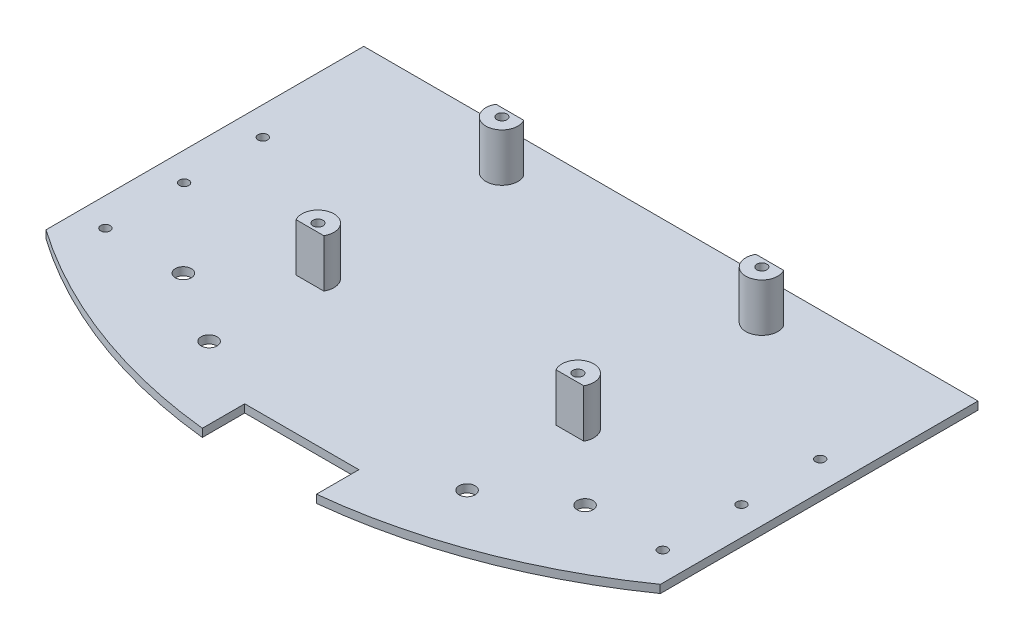
ISO-10303-21;
HEADER;
FILE_DESCRIPTION(('STEP AP214'),'2;1');
FILE_NAME('part.step','',(''),(''),'','','');
FILE_SCHEMA(('AUTOMOTIVE_DESIGN { 1 0 10303 214 1 1 1 1 }'));
ENDSEC;
DATA;
#1=APPLICATION_CONTEXT('core data for automotive mechanical design processes');
#2=APPLICATION_PROTOCOL_DEFINITION('international standard','automotive_design',2000,#1);
#3=PRODUCT_CONTEXT('',#1,'mechanical');
#4=PRODUCT('Part','Part','',(#3));
#5=PRODUCT_RELATED_PRODUCT_CATEGORY('part','',(#4));
#6=PRODUCT_DEFINITION_FORMATION('','',#4);
#7=PRODUCT_DEFINITION_CONTEXT('part definition',#1,'design');
#8=PRODUCT_DEFINITION('design','',#6,#7);
#9=PRODUCT_DEFINITION_SHAPE('','',#8);
#10=(LENGTH_UNIT() NAMED_UNIT(*) SI_UNIT(.MILLI.,.METRE.));
#11=(NAMED_UNIT(*) PLANE_ANGLE_UNIT() SI_UNIT($,.RADIAN.));
#12=(NAMED_UNIT(*) SI_UNIT($,.STERADIAN.) SOLID_ANGLE_UNIT());
#13=UNCERTAINTY_MEASURE_WITH_UNIT(LENGTH_MEASURE(1.E-05),#10,'distance_accuracy_value','');
#14=(GEOMETRIC_REPRESENTATION_CONTEXT(3) GLOBAL_UNCERTAINTY_ASSIGNED_CONTEXT((#13)) GLOBAL_UNIT_ASSIGNED_CONTEXT((#10,
#11,#12)) REPRESENTATION_CONTEXT('',''));
#15=CARTESIAN_POINT('',(0.,0.,0.));
#16=DIRECTION('',(0.,0.,1.));
#17=DIRECTION('',(1.,0.,0.));
#18=AXIS2_PLACEMENT_3D('',#15,#16,#17);
#19=CARTESIAN_POINT('',(0.,2.54,0.));
#20=DIRECTION('',(0.,-1.,0.));
#21=DIRECTION('',(0.,0.,-1.));
#22=AXIS2_PLACEMENT_3D('',#19,#20,#21);
#23=PLANE('',#22);
#24=DIRECTION('',(1.,0.,0.));
#25=VECTOR('',#24,1.);
#26=CARTESIAN_POINT('',(0.,2.54,-78.74));
#27=LINE('',#26,#25);
#28=CARTESIAN_POINT('',(52.1718334230053,2.54,-78.74));
#29=VERTEX_POINT('',#28);
#30=CARTESIAN_POINT('',(60.9706515254552,2.54,-78.74));
#31=VERTEX_POINT('',#30);
#32=EDGE_CURVE('E176',#29,#31,#27,.T.);
#33=ORIENTED_EDGE('',*,*,#32,.F.);
#34=CARTESIAN_POINT('',(56.5712424742303,2.54,-81.28));
#35=DIRECTION('',(0.,1.,0.));
#36=DIRECTION('',(0.,0.,1.));
#37=AXIS2_PLACEMENT_3D('',#34,#35,#36);
#38=CIRCLE('',#37,5.08000000000001);
#39=EDGE_CURVE('E55',#31,#29,#38,.T.);
#40=ORIENTED_EDGE('',*,*,#39,.F.);
#41=EDGE_LOOP('',(#33,#40));
#42=FACE_BOUND('',#41,.T.);
#43=CARTESIAN_POINT('',(56.5712424742303,2.54,-139.7));
#44=DIRECTION('',(0.,1.,0.));
#45=DIRECTION('',(0.,0.,1.));
#46=AXIS2_PLACEMENT_3D('',#43,#44,#45);
#47=CIRCLE('',#46,5.07999999999999);
#48=CARTESIAN_POINT('',(52.1718334230053,2.54,-142.24));
#49=VERTEX_POINT('',#48);
#50=CARTESIAN_POINT('',(60.9706515254552,2.54,-142.24));
#51=VERTEX_POINT('',#50);
#52=EDGE_CURVE('E222',#49,#51,#47,.T.);
#53=ORIENTED_EDGE('',*,*,#52,.F.);
#54=DIRECTION('',(1.,0.,0.));
#55=VECTOR('',#54,1.);
#56=CARTESIAN_POINT('',(0.,2.54,-142.24));
#57=LINE('',#56,#55);
#58=EDGE_CURVE('E217',#49,#51,#57,.T.);
#59=ORIENTED_EDGE('',*,*,#58,.T.);
#60=EDGE_LOOP('',(#53,#59));
#61=FACE_BOUND('',#60,.T.);
#62=CARTESIAN_POINT('',(9.00000000000001,2.54,-86.35));
#63=DIRECTION('',(0.,1.,0.));
#64=DIRECTION('',(0.,0.,1.));
#65=AXIS2_PLACEMENT_3D('',#62,#63,#64);
#66=CIRCLE('',#65,1.5);
#67=CARTESIAN_POINT('',(9.00000000000001,2.54,-84.85));
#68=VERTEX_POINT('',#67);
#69=EDGE_CURVE('E285',#68,#68,#66,.T.);
#70=ORIENTED_EDGE('',*,*,#69,.F.);
#71=EDGE_LOOP('',(#70));
#72=FACE_BOUND('',#71,.T.);
#73=CARTESIAN_POINT('',(9.00000000000001,2.54,-111.35));
#74=DIRECTION('',(0.,1.,0.));
#75=DIRECTION('',(0.,0.,1.));
#76=AXIS2_PLACEMENT_3D('',#73,#74,#75);
#77=CIRCLE('',#76,1.5);
#78=CARTESIAN_POINT('',(9.00000000000001,2.54,-109.85));
#79=VERTEX_POINT('',#78);
#80=EDGE_CURVE('E327',#79,#79,#77,.T.);
#81=ORIENTED_EDGE('',*,*,#80,.F.);
#82=EDGE_LOOP('',(#81));
#83=FACE_BOUND('',#82,.T.);
#84=CARTESIAN_POINT('',(186.,2.54,-111.35));
#85=DIRECTION('',(0.,1.,0.));
#86=DIRECTION('',(0.,0.,1.));
#87=AXIS2_PLACEMENT_3D('',#84,#85,#86);
#88=CIRCLE('',#87,1.5);
#89=CARTESIAN_POINT('',(186.,2.54,-109.85));
#90=VERTEX_POINT('',#89);
#91=EDGE_CURVE('E321',#90,#90,#88,.T.);
#92=ORIENTED_EDGE('',*,*,#91,.F.);
#93=EDGE_LOOP('',(#92));
#94=FACE_BOUND('',#93,.T.);
#95=CARTESIAN_POINT('',(186.,2.54,-86.35));
#96=DIRECTION('',(0.,1.,0.));
#97=DIRECTION('',(0.,0.,1.));
#98=AXIS2_PLACEMENT_3D('',#95,#96,#97);
#99=CIRCLE('',#98,1.5);
#100=CARTESIAN_POINT('',(186.,2.54,-84.85));
#101=VERTEX_POINT('',#100);
#102=EDGE_CURVE('E313',#101,#101,#99,.T.);
#103=ORIENTED_EDGE('',*,*,#102,.F.);
#104=EDGE_LOOP('',(#103));
#105=FACE_BOUND('',#104,.T.);
#106=CARTESIAN_POINT('',(186.,2.54,-61.35));
#107=DIRECTION('',(0.,1.,0.));
#108=DIRECTION('',(0.,0.,1.));
#109=AXIS2_PLACEMENT_3D('',#106,#107,#108);
#110=CIRCLE('',#109,1.5);
#111=CARTESIAN_POINT('',(186.,2.54,-59.85));
#112=VERTEX_POINT('',#111);
#113=EDGE_CURVE('E320',#112,#112,#110,.T.);
#114=ORIENTED_EDGE('',*,*,#113,.F.);
#115=EDGE_LOOP('',(#114));
#116=FACE_BOUND('',#115,.T.);
#117=CARTESIAN_POINT('',(33.7376441434235,2.54,-61.35));
#118=DIRECTION('',(0.,1.,0.));
#119=DIRECTION('',(0.,0.,1.));
#120=AXIS2_PLACEMENT_3D('',#117,#118,#119);
#121=CIRCLE('',#120,2.54);
#122=CARTESIAN_POINT('',(33.7376441434235,2.54,-58.81));
#123=VERTEX_POINT('',#122);
#124=EDGE_CURVE('E272',#123,#123,#121,.T.);
#125=ORIENTED_EDGE('',*,*,#124,.F.);
#126=EDGE_LOOP('',(#125));
#127=FACE_BOUND('',#126,.T.);
#128=CARTESIAN_POINT('',(56.5712424742303,2.54,-46.7057398290593));
#129=DIRECTION('',(0.,1.,0.));
#130=DIRECTION('',(0.,0.,1.));
#131=AXIS2_PLACEMENT_3D('',#128,#129,#130);
#132=CIRCLE('',#131,2.54);
#133=CARTESIAN_POINT('',(56.5712424742303,2.54,-44.1657398290593));
#134=VERTEX_POINT('',#133);
#135=EDGE_CURVE('E264',#134,#134,#132,.T.);
#136=ORIENTED_EDGE('',*,*,#135,.F.);
#137=EDGE_LOOP('',(#136));
#138=FACE_BOUND('',#137,.T.);
#139=CARTESIAN_POINT('',(9.00000000000001,2.54,-61.35));
#140=DIRECTION('',(0.,1.,0.));
#141=DIRECTION('',(0.,0.,1.));
#142=AXIS2_PLACEMENT_3D('',#139,#140,#141);
#143=CIRCLE('',#142,1.5);
#144=CARTESIAN_POINT('',(9.00000000000001,2.54,-59.85));
#145=VERTEX_POINT('',#144);
#146=EDGE_CURVE('E278',#145,#145,#143,.T.);
#147=ORIENTED_EDGE('',*,*,#146,.F.);
#148=EDGE_LOOP('',(#147));
#149=FACE_BOUND('',#148,.T.);
#150=CARTESIAN_POINT('',(161.334355856577,2.54,-61.35));
#151=DIRECTION('',(0.,1.,0.));
#152=DIRECTION('',(0.,0.,-1.));
#153=AXIS2_PLACEMENT_3D('',#150,#151,#152);
#154=CIRCLE('',#153,2.54000000000001);
#155=CARTESIAN_POINT('',(161.334355856577,2.54,-63.89));
#156=VERTEX_POINT('',#155);
#157=EDGE_CURVE('E303',#156,#156,#154,.T.);
#158=ORIENTED_EDGE('',*,*,#157,.F.);
#159=EDGE_LOOP('',(#158));
#160=FACE_BOUND('',#159,.T.);
#161=CARTESIAN_POINT('',(138.50075752577,2.54,-46.7057398290593));
#162=DIRECTION('',(0.,1.,0.));
#163=DIRECTION('',(0.,0.,-1.));
#164=AXIS2_PLACEMENT_3D('',#161,#162,#163);
#165=CIRCLE('',#164,2.54000000000001);
#166=CARTESIAN_POINT('',(138.50075752577,2.54,-49.2457398290593));
#167=VERTEX_POINT('',#166);
#168=EDGE_CURVE('E245',#167,#167,#165,.T.);
#169=ORIENTED_EDGE('',*,*,#168,.F.);
#170=EDGE_LOOP('',(#169));
#171=FACE_BOUND('',#170,.T.);
#172=DIRECTION('',(1.,0.,0.));
#173=VECTOR('',#172,1.);
#174=CARTESIAN_POINT('',(0.,2.54,-51.4885552279454));
#175=LINE('',#174,#173);
#176=CARTESIAN_POINT('',(195.,2.54,-51.4885552279454));
#177=VERTEX_POINT('',#176);
#178=CARTESIAN_POINT('',(195.072,2.54,-51.4885552279454));
#179=VERTEX_POINT('',#178);
#180=EDGE_CURVE('E237',#177,#179,#175,.T.);
#181=ORIENTED_EDGE('',*,*,#180,.T.);
#182=DIRECTION('',(0.,0.,-1.));
#183=VECTOR('',#182,1.);
#184=CARTESIAN_POINT('',(195.072,2.54,0.));
#185=LINE('',#184,#183);
#186=CARTESIAN_POINT('',(195.072,2.54,-152.4));
#187=VERTEX_POINT('',#186);
#188=EDGE_CURVE('E358',#179,#187,#185,.T.);
#189=ORIENTED_EDGE('',*,*,#188,.T.);
#190=DIRECTION('',(-1.,0.,0.));
#191=VECTOR('',#190,1.);
#192=CARTESIAN_POINT('',(0.,2.54,-152.4));
#193=LINE('',#192,#191);
#194=CARTESIAN_POINT('',(0.,2.54,-152.4));
#195=VERTEX_POINT('',#194);
#196=EDGE_CURVE('E361',#187,#195,#193,.T.);
#197=ORIENTED_EDGE('',*,*,#196,.T.);
#198=DIRECTION('',(0.,0.,1.));
#199=VECTOR('',#198,1.);
#200=CARTESIAN_POINT('',(0.,2.54,0.));
#201=LINE('',#200,#199);
#202=CARTESIAN_POINT('',(0.,2.54,-51.4885552279454));
#203=VERTEX_POINT('',#202);
#204=EDGE_CURVE('E355',#195,#203,#201,.T.);
#205=ORIENTED_EDGE('',*,*,#204,.T.);
#206=CARTESIAN_POINT('',(97.5,2.54,-190.75));
#207=DIRECTION('',(0.,1.,0.));
#208=DIRECTION('',(0.,0.,1.));
#209=AXIS2_PLACEMENT_3D('',#206,#207,#208);
#210=CIRCLE('',#209,170.);
#211=CARTESIAN_POINT('',(79.4085319033988,2.54,-21.7153917621908));
#212=VERTEX_POINT('',#211);
#213=EDGE_CURVE('E249',#203,#212,#210,.T.);
#214=ORIENTED_EDGE('',*,*,#213,.T.);
#215=DIRECTION('',(0.,0.,1.));
#216=VECTOR('',#215,1.);
#217=CARTESIAN_POINT('',(79.4085319033988,2.54,-35.1918965634894));
#218=LINE('',#217,#216);
#219=CARTESIAN_POINT('',(79.4085319033988,2.54,-35.1918965634894));
#220=VERTEX_POINT('',#219);
#221=EDGE_CURVE('E271',#220,#212,#218,.T.);
#222=ORIENTED_EDGE('',*,*,#221,.F.);
#223=DIRECTION('',(-1.,0.,0.));
#224=VECTOR('',#223,1.);
#225=CARTESIAN_POINT('',(79.4085319033988,2.54,-35.1918965634894));
#226=LINE('',#225,#224);
#227=CARTESIAN_POINT('',(115.663468096601,2.54,-35.1918965634894));
#228=VERTEX_POINT('',#227);
#229=EDGE_CURVE('E286',#228,#220,#226,.T.);
#230=ORIENTED_EDGE('',*,*,#229,.F.);
#231=DIRECTION('',(0.,0.,-1.));
#232=VECTOR('',#231,1.);
#233=CARTESIAN_POINT('',(115.663468096601,2.54,-35.1918965634894));
#234=LINE('',#233,#232);
#235=CARTESIAN_POINT('',(115.663468096601,2.54,-21.7231133023396));
#236=VERTEX_POINT('',#235);
#237=EDGE_CURVE('E290',#236,#228,#234,.T.);
#238=ORIENTED_EDGE('',*,*,#237,.F.);
#239=CARTESIAN_POINT('',(97.5,2.54,-190.75));
#240=DIRECTION('',(0.,1.,0.));
#241=DIRECTION('',(0.,0.,1.));
#242=AXIS2_PLACEMENT_3D('',#239,#240,#241);
#243=CIRCLE('',#242,170.);
#244=EDGE_CURVE('E242',#236,#177,#243,.T.);
#245=ORIENTED_EDGE('',*,*,#244,.T.);
#246=EDGE_LOOP('',(#181,#189,#197,#205,#214,#222,#230,#238,#245));
#247=FACE_BOUND('',#246,.T.);
#248=DIRECTION('',(-1.,0.,0.));
#249=VECTOR('',#248,1.);
#250=CARTESIAN_POINT('',(0.,2.54,-142.24));
#251=LINE('',#250,#249);
#252=CARTESIAN_POINT('',(143.520651525455,2.54,-142.24));
#253=VERTEX_POINT('',#252);
#254=CARTESIAN_POINT('',(134.721833423005,2.54,-142.24));
#255=VERTEX_POINT('',#254);
#256=EDGE_CURVE('E197',#253,#255,#251,.T.);
#257=ORIENTED_EDGE('',*,*,#256,.F.);
#258=CARTESIAN_POINT('',(139.12124247423,2.54,-139.7));
#259=DIRECTION('',(0.,1.,0.));
#260=DIRECTION('',(0.,0.,1.));
#261=AXIS2_PLACEMENT_3D('',#258,#259,#260);
#262=CIRCLE('',#261,5.07999999999999);
#263=EDGE_CURVE('E202',#255,#253,#262,.T.);
#264=ORIENTED_EDGE('',*,*,#263,.F.);
#265=EDGE_LOOP('',(#257,#264));
#266=FACE_BOUND('',#265,.T.);
#267=CARTESIAN_POINT('',(139.12124247423,2.54,-81.28));
#268=DIRECTION('',(0.,1.,0.));
#269=DIRECTION('',(0.,0.,1.));
#270=AXIS2_PLACEMENT_3D('',#267,#268,#269);
#271=CIRCLE('',#270,5.07999999999999);
#272=CARTESIAN_POINT('',(143.520651525455,2.54,-78.74));
#273=VERTEX_POINT('',#272);
#274=CARTESIAN_POINT('',(134.721833423005,2.54,-78.74));
#275=VERTEX_POINT('',#274);
#276=EDGE_CURVE('E62',#273,#275,#271,.T.);
#277=ORIENTED_EDGE('',*,*,#276,.F.);
#278=DIRECTION('',(-1.,0.,0.));
#279=VECTOR('',#278,1.);
#280=CARTESIAN_POINT('',(0.,2.54,-78.74));
#281=LINE('',#280,#279);
#282=EDGE_CURVE('E177',#273,#275,#281,.T.);
#283=ORIENTED_EDGE('',*,*,#282,.T.);
#284=EDGE_LOOP('',(#277,#283));
#285=FACE_BOUND('',#284,.T.);
#286=ADVANCED_FACE('F41',(#42,#61,#72,#83,#94,#105,#116,#127,#138,#149,#160,#171,#247,#266,
#285),#23,.F.);
#287=CARTESIAN_POINT('',(0.,2.54,0.));
#288=DIRECTION('',(1.,0.,0.));
#289=DIRECTION('',(0.,0.,-1.));
#290=AXIS2_PLACEMENT_3D('',#287,#288,#289);
#291=PLANE('',#290);
#292=DIRECTION('',(0.,1.,0.));
#293=VECTOR('',#292,1.);
#294=CARTESIAN_POINT('',(0.,-94.6402993365633,-51.4885552279454));
#295=LINE('',#294,#293);
#296=CARTESIAN_POINT('',(0.,0.,-51.4885552279454));
#297=VERTEX_POINT('',#296);
#298=EDGE_CURVE('E258',#297,#203,#295,.T.);
#299=ORIENTED_EDGE('',*,*,#298,.T.);
#300=ORIENTED_EDGE('',*,*,#204,.F.);
#301=DIRECTION('',(0.,-1.,0.));
#302=VECTOR('',#301,1.);
#303=CARTESIAN_POINT('',(0.,2.54,-152.4));
#304=LINE('',#303,#302);
#305=CARTESIAN_POINT('',(0.,0.,-152.4));
#306=VERTEX_POINT('',#305);
#307=EDGE_CURVE('E363',#195,#306,#304,.T.);
#308=ORIENTED_EDGE('',*,*,#307,.T.);
#309=DIRECTION('',(0.,0.,1.));
#310=VECTOR('',#309,1.);
#311=CARTESIAN_POINT('',(0.,0.,0.));
#312=LINE('',#311,#310);
#313=EDGE_CURVE('E354',#306,#297,#312,.T.);
#314=ORIENTED_EDGE('',*,*,#313,.T.);
#315=EDGE_LOOP('',(#299,#300,#308,#314));
#316=FACE_BOUND('',#315,.T.);
#317=ADVANCED_FACE('F43',(#316),#291,.F.);
#318=CARTESIAN_POINT('',(195.072,2.54,0.));
#319=DIRECTION('',(-1.,0.,0.));
#320=DIRECTION('',(0.,0.,1.));
#321=AXIS2_PLACEMENT_3D('',#318,#319,#320);
#322=PLANE('',#321);
#323=DIRECTION('',(0.,1.,0.));
#324=VECTOR('',#323,1.);
#325=CARTESIAN_POINT('',(195.072,-94.6402993365633,-51.4885552279454));
#326=LINE('',#325,#324);
#327=CARTESIAN_POINT('',(195.072,0.,-51.4885552279454));
#328=VERTEX_POINT('',#327);
#329=EDGE_CURVE('E251',#328,#179,#326,.T.);
#330=ORIENTED_EDGE('',*,*,#329,.F.);
#331=DIRECTION('',(0.,0.,-1.));
#332=VECTOR('',#331,1.);
#333=CARTESIAN_POINT('',(195.072,0.,0.));
#334=LINE('',#333,#332);
#335=CARTESIAN_POINT('',(195.072,0.,-152.4));
#336=VERTEX_POINT('',#335);
#337=EDGE_CURVE('E366',#328,#336,#334,.T.);
#338=ORIENTED_EDGE('',*,*,#337,.T.);
#339=DIRECTION('',(0.,-1.,0.));
#340=VECTOR('',#339,1.);
#341=CARTESIAN_POINT('',(195.072,2.54,-152.4));
#342=LINE('',#341,#340);
#343=EDGE_CURVE('E49',#187,#336,#342,.T.);
#344=ORIENTED_EDGE('',*,*,#343,.F.);
#345=ORIENTED_EDGE('',*,*,#188,.F.);
#346=EDGE_LOOP('',(#330,#338,#344,#345));
#347=FACE_BOUND('',#346,.T.);
#348=ADVANCED_FACE('F392',(#347),#322,.F.);
#349=CARTESIAN_POINT('',(0.,0.,0.));
#350=DIRECTION('',(0.,-1.,0.));
#351=DIRECTION('',(0.,0.,-1.));
#352=AXIS2_PLACEMENT_3D('',#349,#350,#351);
#353=PLANE('',#352);
#354=CARTESIAN_POINT('',(9.00000000000001,0.,-86.35));
#355=DIRECTION('',(0.,-1.,0.));
#356=DIRECTION('',(0.,0.,-1.));
#357=AXIS2_PLACEMENT_3D('',#354,#355,#356);
#358=CIRCLE('',#357,1.5);
#359=CARTESIAN_POINT('',(9.00000000000001,0.,-87.85));
#360=VERTEX_POINT('',#359);
#361=EDGE_CURVE('E330',#360,#360,#358,.F.);
#362=ORIENTED_EDGE('',*,*,#361,.T.);
#363=EDGE_LOOP('',(#362));
#364=FACE_BOUND('',#363,.T.);
#365=CARTESIAN_POINT('',(9.00000000000001,0.,-111.35));
#366=DIRECTION('',(0.,-1.,0.));
#367=DIRECTION('',(0.,0.,-1.));
#368=AXIS2_PLACEMENT_3D('',#365,#366,#367);
#369=CIRCLE('',#368,1.5);
#370=CARTESIAN_POINT('',(9.00000000000001,0.,-112.85));
#371=VERTEX_POINT('',#370);
#372=EDGE_CURVE('E324',#371,#371,#369,.F.);
#373=ORIENTED_EDGE('',*,*,#372,.T.);
#374=EDGE_LOOP('',(#373));
#375=FACE_BOUND('',#374,.T.);
#376=CARTESIAN_POINT('',(186.,0.,-111.35));
#377=DIRECTION('',(0.,-1.,0.));
#378=DIRECTION('',(0.,0.,-1.));
#379=AXIS2_PLACEMENT_3D('',#376,#377,#378);
#380=CIRCLE('',#379,1.5);
#381=CARTESIAN_POINT('',(186.,0.,-112.85));
#382=VERTEX_POINT('',#381);
#383=EDGE_CURVE('E317',#382,#382,#380,.F.);
#384=ORIENTED_EDGE('',*,*,#383,.T.);
#385=EDGE_LOOP('',(#384));
#386=FACE_BOUND('',#385,.T.);
#387=CARTESIAN_POINT('',(186.,0.,-86.35));
#388=DIRECTION('',(0.,-1.,0.));
#389=DIRECTION('',(0.,0.,-1.));
#390=AXIS2_PLACEMENT_3D('',#387,#388,#389);
#391=CIRCLE('',#390,1.5);
#392=CARTESIAN_POINT('',(186.,0.,-87.85));
#393=VERTEX_POINT('',#392);
#394=EDGE_CURVE('E316',#393,#393,#391,.F.);
#395=ORIENTED_EDGE('',*,*,#394,.T.);
#396=EDGE_LOOP('',(#395));
#397=FACE_BOUND('',#396,.T.);
#398=CARTESIAN_POINT('',(139.12124247423,0.,-139.7));
#399=DIRECTION('',(0.,-1.,0.));
#400=DIRECTION('',(0.,0.,-1.));
#401=AXIS2_PLACEMENT_3D('',#398,#399,#400);
#402=CIRCLE('',#401,1.58750000000001);
#403=CARTESIAN_POINT('',(139.12124247423,0.,-141.2875));
#404=VERTEX_POINT('',#403);
#405=EDGE_CURVE('E346',#404,#404,#402,.F.);
#406=ORIENTED_EDGE('',*,*,#405,.T.);
#407=EDGE_LOOP('',(#406));
#408=FACE_BOUND('',#407,.T.);
#409=CARTESIAN_POINT('',(139.12124247423,0.,-81.28));
#410=DIRECTION('',(0.,-1.,0.));
#411=DIRECTION('',(0.,0.,-1.));
#412=AXIS2_PLACEMENT_3D('',#409,#410,#411);
#413=CIRCLE('',#412,1.58750000000002);
#414=CARTESIAN_POINT('',(139.12124247423,0.,-82.8675));
#415=VERTEX_POINT('',#414);
#416=EDGE_CURVE('E340',#415,#415,#413,.F.);
#417=ORIENTED_EDGE('',*,*,#416,.T.);
#418=EDGE_LOOP('',(#417));
#419=FACE_BOUND('',#418,.T.);
#420=CARTESIAN_POINT('',(56.5712424742303,0.,-81.28));
#421=DIRECTION('',(0.,-1.,0.));
#422=DIRECTION('',(0.,0.,-1.));
#423=AXIS2_PLACEMENT_3D('',#420,#421,#422);
#424=CIRCLE('',#423,1.58750000000001);
#425=CARTESIAN_POINT('',(56.5712424742303,0.,-82.8675));
#426=VERTEX_POINT('',#425);
#427=EDGE_CURVE('E337',#426,#426,#424,.F.);
#428=ORIENTED_EDGE('',*,*,#427,.T.);
#429=EDGE_LOOP('',(#428));
#430=FACE_BOUND('',#429,.T.);
#431=CARTESIAN_POINT('',(186.,0.,-61.35));
#432=DIRECTION('',(0.,-1.,0.));
#433=DIRECTION('',(0.,0.,-1.));
#434=AXIS2_PLACEMENT_3D('',#431,#432,#433);
#435=CIRCLE('',#434,1.5);
#436=CARTESIAN_POINT('',(186.,0.,-62.85));
#437=VERTEX_POINT('',#436);
#438=EDGE_CURVE('E341',#437,#437,#435,.F.);
#439=ORIENTED_EDGE('',*,*,#438,.T.);
#440=EDGE_LOOP('',(#439));
#441=FACE_BOUND('',#440,.T.);
#442=CARTESIAN_POINT('',(33.7376441434235,0.,-61.35));
#443=DIRECTION('',(0.,-1.,0.));
#444=DIRECTION('',(0.,0.,-1.));
#445=AXIS2_PLACEMENT_3D('',#442,#443,#444);
#446=CIRCLE('',#445,2.54);
#447=CARTESIAN_POINT('',(33.7376441434235,0.,-63.89));
#448=VERTEX_POINT('',#447);
#449=EDGE_CURVE('E268',#448,#448,#446,.F.);
#450=ORIENTED_EDGE('',*,*,#449,.T.);
#451=EDGE_LOOP('',(#450));
#452=FACE_BOUND('',#451,.T.);
#453=CARTESIAN_POINT('',(56.5712424742303,0.,-46.7057398290593));
#454=DIRECTION('',(0.,-1.,0.));
#455=DIRECTION('',(0.,0.,-1.));
#456=AXIS2_PLACEMENT_3D('',#453,#454,#455);
#457=CIRCLE('',#456,2.54);
#458=CARTESIAN_POINT('',(56.5712424742303,0.,-49.2457398290593));
#459=VERTEX_POINT('',#458);
#460=EDGE_CURVE('E267',#459,#459,#457,.F.);
#461=ORIENTED_EDGE('',*,*,#460,.T.);
#462=EDGE_LOOP('',(#461));
#463=FACE_BOUND('',#462,.T.);
#464=CARTESIAN_POINT('',(9.00000000000001,0.,-61.35));
#465=DIRECTION('',(0.,-1.,0.));
#466=DIRECTION('',(0.,0.,-1.));
#467=AXIS2_PLACEMENT_3D('',#464,#465,#466);
#468=CIRCLE('',#467,1.5);
#469=CARTESIAN_POINT('',(9.00000000000001,0.,-62.85));
#470=VERTEX_POINT('',#469);
#471=EDGE_CURVE('E281',#470,#470,#468,.F.);
#472=ORIENTED_EDGE('',*,*,#471,.T.);
#473=EDGE_LOOP('',(#472));
#474=FACE_BOUND('',#473,.T.);
#475=CARTESIAN_POINT('',(161.334355856577,0.,-61.35));
#476=DIRECTION('',(0.,-1.,0.));
#477=DIRECTION('',(0.,0.,-1.));
#478=AXIS2_PLACEMENT_3D('',#475,#476,#477);
#479=CIRCLE('',#478,2.54000000000001);
#480=CARTESIAN_POINT('',(161.334355856577,0.,-63.89));
#481=VERTEX_POINT('',#480);
#482=EDGE_CURVE('E275',#481,#481,#479,.F.);
#483=ORIENTED_EDGE('',*,*,#482,.T.);
#484=EDGE_LOOP('',(#483));
#485=FACE_BOUND('',#484,.T.);
#486=CARTESIAN_POINT('',(138.50075752577,0.,-46.7057398290593));
#487=DIRECTION('',(0.,-1.,0.));
#488=DIRECTION('',(0.,0.,-1.));
#489=AXIS2_PLACEMENT_3D('',#486,#487,#488);
#490=CIRCLE('',#489,2.54000000000001);
#491=CARTESIAN_POINT('',(138.50075752577,0.,-49.2457398290593));
#492=VERTEX_POINT('',#491);
#493=EDGE_CURVE('E306',#492,#492,#490,.F.);
#494=ORIENTED_EDGE('',*,*,#493,.T.);
#495=EDGE_LOOP('',(#494));
#496=FACE_BOUND('',#495,.T.);
#497=CARTESIAN_POINT('',(56.5712424742303,0.,-139.7));
#498=DIRECTION('',(0.,-1.,0.));
#499=DIRECTION('',(0.,0.,-1.));
#500=AXIS2_PLACEMENT_3D('',#497,#498,#499);
#501=CIRCLE('',#500,1.58750000000001);
#502=CARTESIAN_POINT('',(56.5712424742303,0.,-141.2875));
#503=VERTEX_POINT('',#502);
#504=EDGE_CURVE('E349',#503,#503,#501,.F.);
#505=ORIENTED_EDGE('',*,*,#504,.T.);
#506=EDGE_LOOP('',(#505));
#507=FACE_BOUND('',#506,.T.);
#508=ORIENTED_EDGE('',*,*,#337,.F.);
#509=DIRECTION('',(1.,0.,0.));
#510=VECTOR('',#509,1.);
#511=CARTESIAN_POINT('',(0.,0.,-51.4885552279454));
#512=LINE('',#511,#510);
#513=CARTESIAN_POINT('',(195.,0.,-51.4885552279454));
#514=VERTEX_POINT('',#513);
#515=EDGE_CURVE('E248',#514,#328,#512,.T.);
#516=ORIENTED_EDGE('',*,*,#515,.F.);
#517=CARTESIAN_POINT('',(97.5,0.,-190.75));
#518=DIRECTION('',(0.,-1.,0.));
#519=DIRECTION('',(0.,0.,-1.));
#520=AXIS2_PLACEMENT_3D('',#517,#518,#519);
#521=CIRCLE('',#520,170.);
#522=CARTESIAN_POINT('',(115.663468096601,0.,-21.7231133023396));
#523=VERTEX_POINT('',#522);
#524=EDGE_CURVE('E246',#523,#514,#521,.F.);
#525=ORIENTED_EDGE('',*,*,#524,.F.);
#526=DIRECTION('',(0.,0.,1.));
#527=VECTOR('',#526,1.);
#528=CARTESIAN_POINT('',(115.663468096601,0.,0.));
#529=LINE('',#528,#527);
#530=CARTESIAN_POINT('',(115.663468096601,0.,-35.1918965634894));
#531=VERTEX_POINT('',#530);
#532=EDGE_CURVE('E11',#531,#523,#529,.T.);
#533=ORIENTED_EDGE('',*,*,#532,.F.);
#534=DIRECTION('',(-1.,0.,0.));
#535=VECTOR('',#534,1.);
#536=CARTESIAN_POINT('',(79.4085319033988,0.,-35.1918965634894));
#537=LINE('',#536,#535);
#538=CARTESIAN_POINT('',(79.4085319033988,0.,-35.1918965634894));
#539=VERTEX_POINT('',#538);
#540=EDGE_CURVE('E297',#531,#539,#537,.T.);
#541=ORIENTED_EDGE('',*,*,#540,.T.);
#542=DIRECTION('',(0.,0.,1.));
#543=VECTOR('',#542,1.);
#544=CARTESIAN_POINT('',(79.4085319033988,0.,-35.1918965634894));
#545=LINE('',#544,#543);
#546=CARTESIAN_POINT('',(79.4085319033988,0.,-21.7153917621908));
#547=VERTEX_POINT('',#546);
#548=EDGE_CURVE('E282',#539,#547,#545,.T.);
#549=ORIENTED_EDGE('',*,*,#548,.T.);
#550=CARTESIAN_POINT('',(97.5,0.,-190.75));
#551=DIRECTION('',(0.,-1.,0.));
#552=DIRECTION('',(0.,0.,-1.));
#553=AXIS2_PLACEMENT_3D('',#550,#551,#552);
#554=CIRCLE('',#553,170.);
#555=EDGE_CURVE('E236',#297,#547,#554,.F.);
#556=ORIENTED_EDGE('',*,*,#555,.F.);
#557=ORIENTED_EDGE('',*,*,#313,.F.);
#558=DIRECTION('',(-1.,0.,0.));
#559=VECTOR('',#558,1.);
#560=CARTESIAN_POINT('',(0.,0.,-152.4));
#561=LINE('',#560,#559);
#562=EDGE_CURVE('E359',#336,#306,#561,.T.);
#563=ORIENTED_EDGE('',*,*,#562,.F.);
#564=EDGE_LOOP('',(#508,#516,#525,#533,#541,#549,#556,#557,#563));
#565=FACE_BOUND('',#564,.T.);
#566=ADVANCED_FACE('F382',(#364,#375,#386,#397,#408,#419,#430,#441,#452,#463,#474,#485,#496,
#507,#565),#353,.T.);
#567=CARTESIAN_POINT('',(115.663468096601,-58.8412450850553,-35.1918965634894));
#568=DIRECTION('',(1.,0.,0.));
#569=DIRECTION('',(0.,0.,-1.));
#570=AXIS2_PLACEMENT_3D('',#567,#568,#569);
#571=PLANE('',#570);
#572=DIRECTION('',(0.,1.,0.));
#573=VECTOR('',#572,1.);
#574=CARTESIAN_POINT('',(115.663468096601,-94.6402993365633,-21.7231133023396));
#575=LINE('',#574,#573);
#576=EDGE_CURVE('E240',#523,#236,#575,.T.);
#577=ORIENTED_EDGE('',*,*,#576,.T.);
#578=ORIENTED_EDGE('',*,*,#237,.T.);
#579=DIRECTION('',(0.,1.,0.));
#580=VECTOR('',#579,1.);
#581=CARTESIAN_POINT('',(115.663468096601,-58.8412450850553,-35.1918965634894));
#582=LINE('',#581,#580);
#583=EDGE_CURVE('E289',#531,#228,#582,.T.);
#584=ORIENTED_EDGE('',*,*,#583,.F.);
#585=ORIENTED_EDGE('',*,*,#532,.T.);
#586=EDGE_LOOP('',(#577,#578,#584,#585));
#587=FACE_BOUND('',#586,.T.);
#588=ADVANCED_FACE('F401',(#587),#571,.F.);
#589=CARTESIAN_POINT('',(79.4085319033988,-58.8412450850553,-35.1918965634894));
#590=DIRECTION('',(-1.,0.,0.));
#591=DIRECTION('',(0.,0.,1.));
#592=AXIS2_PLACEMENT_3D('',#589,#590,#591);
#593=PLANE('',#592);
#594=DIRECTION('',(0.,1.,0.));
#595=VECTOR('',#594,1.);
#596=CARTESIAN_POINT('',(79.4085319033988,-94.6402993365633,-21.7153917621908));
#597=LINE('',#596,#595);
#598=EDGE_CURVE('E260',#547,#212,#597,.T.);
#599=ORIENTED_EDGE('',*,*,#598,.F.);
#600=ORIENTED_EDGE('',*,*,#548,.F.);
#601=DIRECTION('',(0.,1.,0.));
#602=VECTOR('',#601,1.);
#603=CARTESIAN_POINT('',(79.4085319033988,-58.8412450850553,-35.1918965634894));
#604=LINE('',#603,#602);
#605=EDGE_CURVE('E296',#539,#220,#604,.T.);
#606=ORIENTED_EDGE('',*,*,#605,.T.);
#607=ORIENTED_EDGE('',*,*,#221,.T.);
#608=EDGE_LOOP('',(#599,#600,#606,#607));
#609=FACE_BOUND('',#608,.T.);
#610=ADVANCED_FACE('F409',(#609),#593,.F.);
#611=CARTESIAN_POINT('',(0.,2.54,-152.4));
#612=DIRECTION('',(0.,0.,1.));
#613=DIRECTION('',(1.,0.,0.));
#614=AXIS2_PLACEMENT_3D('',#611,#612,#613);
#615=PLANE('',#614);
#616=ORIENTED_EDGE('',*,*,#562,.T.);
#617=ORIENTED_EDGE('',*,*,#307,.F.);
#618=ORIENTED_EDGE('',*,*,#196,.F.);
#619=ORIENTED_EDGE('',*,*,#343,.T.);
#620=EDGE_LOOP('',(#616,#617,#618,#619));
#621=FACE_BOUND('',#620,.T.);
#622=ADVANCED_FACE('F375',(#621),#615,.F.);
#623=CARTESIAN_POINT('',(56.5712424742303,-58.8412450850553,-139.7));
#624=DIRECTION('',(0.,1.,0.));
#625=DIRECTION('',(0.,0.,1.));
#626=AXIS2_PLACEMENT_3D('',#623,#624,#625);
#627=CYLINDRICAL_SURFACE('',#626,1.58750000000001);
#628=ORIENTED_EDGE('',*,*,#504,.F.);
#629=EDGE_LOOP('',(#628));
#630=FACE_BOUND('',#629,.T.);
#631=CARTESIAN_POINT('',(56.5712424742303,17.78,-139.7));
#632=DIRECTION('',(0.,1.,0.));
#633=DIRECTION('',(0.,0.,1.));
#634=AXIS2_PLACEMENT_3D('',#631,#632,#633);
#635=CIRCLE('',#634,1.58750000000001);
#636=CARTESIAN_POINT('',(56.5712424742303,17.78,-138.1125));
#637=VERTEX_POINT('',#636);
#638=EDGE_CURVE('E218',#637,#637,#635,.F.);
#639=ORIENTED_EDGE('',*,*,#638,.F.);
#640=EDGE_LOOP('',(#639));
#641=FACE_BOUND('',#640,.T.);
#642=ADVANCED_FACE('F436',(#630,#641),#627,.F.);
#643=CARTESIAN_POINT('',(138.50075752577,-58.8412450850553,-46.7057398290593));
#644=DIRECTION('',(0.,1.,0.));
#645=DIRECTION('',(0.,0.,1.));
#646=AXIS2_PLACEMENT_3D('',#643,#644,#645);
#647=CYLINDRICAL_SURFACE('',#646,2.54000000000001);
#648=ORIENTED_EDGE('',*,*,#168,.T.);
#649=EDGE_LOOP('',(#648));
#650=FACE_BOUND('',#649,.T.);
#651=ORIENTED_EDGE('',*,*,#493,.F.);
#652=EDGE_LOOP('',(#651));
#653=FACE_BOUND('',#652,.T.);
#654=ADVANCED_FACE('F565',(#650,#653),#647,.F.);
#655=CARTESIAN_POINT('',(161.334355856577,-58.8412450850553,-61.35));
#656=DIRECTION('',(0.,1.,0.));
#657=DIRECTION('',(0.,0.,1.));
#658=AXIS2_PLACEMENT_3D('',#655,#656,#657);
#659=CYLINDRICAL_SURFACE('',#658,2.54000000000001);
#660=ORIENTED_EDGE('',*,*,#157,.T.);
#661=EDGE_LOOP('',(#660));
#662=FACE_BOUND('',#661,.T.);
#663=ORIENTED_EDGE('',*,*,#482,.F.);
#664=EDGE_LOOP('',(#663));
#665=FACE_BOUND('',#664,.T.);
#666=ADVANCED_FACE('F557',(#662,#665),#659,.F.);
#667=CARTESIAN_POINT('',(9.00000000000001,-58.8412450850553,-61.35));
#668=DIRECTION('',(0.,1.,0.));
#669=DIRECTION('',(0.,0.,1.));
#670=AXIS2_PLACEMENT_3D('',#667,#668,#669);
#671=CYLINDRICAL_SURFACE('',#670,1.5);
#672=ORIENTED_EDGE('',*,*,#146,.T.);
#673=EDGE_LOOP('',(#672));
#674=FACE_BOUND('',#673,.T.);
#675=ORIENTED_EDGE('',*,*,#471,.F.);
#676=EDGE_LOOP('',(#675));
#677=FACE_BOUND('',#676,.T.);
#678=ADVANCED_FACE('F550',(#674,#677),#671,.F.);
#679=CARTESIAN_POINT('',(79.4085319033988,-58.8412450850553,-35.1918965634894));
#680=DIRECTION('',(0.,0.,-1.));
#681=DIRECTION('',(-1.,0.,0.));
#682=AXIS2_PLACEMENT_3D('',#679,#680,#681);
#683=PLANE('',#682);
#684=ORIENTED_EDGE('',*,*,#583,.T.);
#685=ORIENTED_EDGE('',*,*,#229,.T.);
#686=ORIENTED_EDGE('',*,*,#605,.F.);
#687=ORIENTED_EDGE('',*,*,#540,.F.);
#688=EDGE_LOOP('',(#684,#685,#686,#687));
#689=FACE_BOUND('',#688,.T.);
#690=ADVANCED_FACE('F405',(#689),#683,.F.);
#691=CARTESIAN_POINT('',(56.5712424742303,-58.8412450850553,-46.7057398290593));
#692=DIRECTION('',(0.,1.,0.));
#693=DIRECTION('',(0.,0.,1.));
#694=AXIS2_PLACEMENT_3D('',#691,#692,#693);
#695=CYLINDRICAL_SURFACE('',#694,2.54);
#696=ORIENTED_EDGE('',*,*,#135,.T.);
#697=EDGE_LOOP('',(#696));
#698=FACE_BOUND('',#697,.T.);
#699=ORIENTED_EDGE('',*,*,#460,.F.);
#700=EDGE_LOOP('',(#699));
#701=FACE_BOUND('',#700,.T.);
#702=ADVANCED_FACE('F536',(#698,#701),#695,.F.);
#703=CARTESIAN_POINT('',(33.7376441434235,-58.8412450850553,-61.35));
#704=DIRECTION('',(0.,1.,0.));
#705=DIRECTION('',(0.,0.,1.));
#706=AXIS2_PLACEMENT_3D('',#703,#704,#705);
#707=CYLINDRICAL_SURFACE('',#706,2.54);
#708=ORIENTED_EDGE('',*,*,#124,.T.);
#709=EDGE_LOOP('',(#708));
#710=FACE_BOUND('',#709,.T.);
#711=ORIENTED_EDGE('',*,*,#449,.F.);
#712=EDGE_LOOP('',(#711));
#713=FACE_BOUND('',#712,.T.);
#714=ADVANCED_FACE('F528',(#710,#713),#707,.F.);
#715=CARTESIAN_POINT('',(186.,-58.8412450850553,-61.35));
#716=DIRECTION('',(0.,1.,0.));
#717=DIRECTION('',(0.,0.,1.));
#718=AXIS2_PLACEMENT_3D('',#715,#716,#717);
#719=CYLINDRICAL_SURFACE('',#718,1.5);
#720=ORIENTED_EDGE('',*,*,#113,.T.);
#721=EDGE_LOOP('',(#720));
#722=FACE_BOUND('',#721,.T.);
#723=ORIENTED_EDGE('',*,*,#438,.F.);
#724=EDGE_LOOP('',(#723));
#725=FACE_BOUND('',#724,.T.);
#726=ADVANCED_FACE('F519',(#722,#725),#719,.F.);
#727=CARTESIAN_POINT('',(56.5712424742303,-58.8412450850553,-81.28));
#728=DIRECTION('',(0.,1.,0.));
#729=DIRECTION('',(0.,0.,1.));
#730=AXIS2_PLACEMENT_3D('',#727,#728,#729);
#731=CYLINDRICAL_SURFACE('',#730,1.58750000000001);
#732=ORIENTED_EDGE('',*,*,#427,.F.);
#733=EDGE_LOOP('',(#732));
#734=FACE_BOUND('',#733,.T.);
#735=CARTESIAN_POINT('',(56.5712424742303,17.78,-81.28));
#736=DIRECTION('',(0.,1.,0.));
#737=DIRECTION('',(0.,0.,1.));
#738=AXIS2_PLACEMENT_3D('',#735,#736,#737);
#739=CIRCLE('',#738,1.58750000000001);
#740=CARTESIAN_POINT('',(56.5712424742303,17.78,-79.6925));
#741=VERTEX_POINT('',#740);
#742=EDGE_CURVE('E173',#741,#741,#739,.F.);
#743=ORIENTED_EDGE('',*,*,#742,.F.);
#744=EDGE_LOOP('',(#743));
#745=FACE_BOUND('',#744,.T.);
#746=ADVANCED_FACE('F510',(#734,#745),#731,.F.);
#747=CARTESIAN_POINT('',(139.12124247423,-58.8412450850553,-81.28));
#748=DIRECTION('',(0.,1.,0.));
#749=DIRECTION('',(0.,0.,1.));
#750=AXIS2_PLACEMENT_3D('',#747,#748,#749);
#751=CYLINDRICAL_SURFACE('',#750,1.58750000000002);
#752=ORIENTED_EDGE('',*,*,#416,.F.);
#753=EDGE_LOOP('',(#752));
#754=FACE_BOUND('',#753,.T.);
#755=CARTESIAN_POINT('',(139.12124247423,17.78,-81.28));
#756=DIRECTION('',(0.,1.,0.));
#757=DIRECTION('',(0.,0.,1.));
#758=AXIS2_PLACEMENT_3D('',#755,#756,#757);
#759=CIRCLE('',#758,1.58750000000002);
#760=CARTESIAN_POINT('',(139.12124247423,17.78,-79.6925));
#761=VERTEX_POINT('',#760);
#762=EDGE_CURVE('E183',#761,#761,#759,.F.);
#763=ORIENTED_EDGE('',*,*,#762,.F.);
#764=EDGE_LOOP('',(#763));
#765=FACE_BOUND('',#764,.T.);
#766=ADVANCED_FACE('F499',(#754,#765),#751,.F.);
#767=CARTESIAN_POINT('',(139.12124247423,-58.8412450850553,-139.7));
#768=DIRECTION('',(0.,1.,0.));
#769=DIRECTION('',(0.,0.,1.));
#770=AXIS2_PLACEMENT_3D('',#767,#768,#769);
#771=CYLINDRICAL_SURFACE('',#770,1.58750000000001);
#772=ORIENTED_EDGE('',*,*,#405,.F.);
#773=EDGE_LOOP('',(#772));
#774=FACE_BOUND('',#773,.T.);
#775=CARTESIAN_POINT('',(139.12124247423,17.78,-139.7));
#776=DIRECTION('',(0.,1.,0.));
#777=DIRECTION('',(0.,0.,1.));
#778=AXIS2_PLACEMENT_3D('',#775,#776,#777);
#779=CIRCLE('',#778,1.58750000000001);
#780=CARTESIAN_POINT('',(139.12124247423,17.78,-138.1125));
#781=VERTEX_POINT('',#780);
#782=EDGE_CURVE('E198',#781,#781,#779,.F.);
#783=ORIENTED_EDGE('',*,*,#782,.F.);
#784=EDGE_LOOP('',(#783));
#785=FACE_BOUND('',#784,.T.);
#786=ADVANCED_FACE('F489',(#774,#785),#771,.F.);
#787=CARTESIAN_POINT('',(186.,-58.8412450850553,-86.35));
#788=DIRECTION('',(0.,1.,0.));
#789=DIRECTION('',(0.,0.,1.));
#790=AXIS2_PLACEMENT_3D('',#787,#788,#789);
#791=CYLINDRICAL_SURFACE('',#790,1.5);
#792=ORIENTED_EDGE('',*,*,#102,.T.);
#793=EDGE_LOOP('',(#792));
#794=FACE_BOUND('',#793,.T.);
#795=ORIENTED_EDGE('',*,*,#394,.F.);
#796=EDGE_LOOP('',(#795));
#797=FACE_BOUND('',#796,.T.);
#798=ADVANCED_FACE('F481',(#794,#797),#791,.F.);
#799=CARTESIAN_POINT('',(186.,-58.8412450850553,-111.35));
#800=DIRECTION('',(0.,1.,0.));
#801=DIRECTION('',(0.,0.,1.));
#802=AXIS2_PLACEMENT_3D('',#799,#800,#801);
#803=CYLINDRICAL_SURFACE('',#802,1.5);
#804=ORIENTED_EDGE('',*,*,#91,.T.);
#805=EDGE_LOOP('',(#804));
#806=FACE_BOUND('',#805,.T.);
#807=ORIENTED_EDGE('',*,*,#383,.F.);
#808=EDGE_LOOP('',(#807));
#809=FACE_BOUND('',#808,.T.);
#810=ADVANCED_FACE('F473',(#806,#809),#803,.F.);
#811=CARTESIAN_POINT('',(9.00000000000001,-58.8412450850553,-111.35));
#812=DIRECTION('',(0.,1.,0.));
#813=DIRECTION('',(0.,0.,1.));
#814=AXIS2_PLACEMENT_3D('',#811,#812,#813);
#815=CYLINDRICAL_SURFACE('',#814,1.5);
#816=ORIENTED_EDGE('',*,*,#80,.T.);
#817=EDGE_LOOP('',(#816));
#818=FACE_BOUND('',#817,.T.);
#819=ORIENTED_EDGE('',*,*,#372,.F.);
#820=EDGE_LOOP('',(#819));
#821=FACE_BOUND('',#820,.T.);
#822=ADVANCED_FACE('F422',(#818,#821),#815,.F.);
#823=CARTESIAN_POINT('',(9.00000000000001,-58.8412450850553,-86.35));
#824=DIRECTION('',(0.,1.,0.));
#825=DIRECTION('',(0.,0.,1.));
#826=AXIS2_PLACEMENT_3D('',#823,#824,#825);
#827=CYLINDRICAL_SURFACE('',#826,1.5);
#828=ORIENTED_EDGE('',*,*,#69,.T.);
#829=EDGE_LOOP('',(#828));
#830=FACE_BOUND('',#829,.T.);
#831=ORIENTED_EDGE('',*,*,#361,.F.);
#832=EDGE_LOOP('',(#831));
#833=FACE_BOUND('',#832,.T.);
#834=ADVANCED_FACE('F413',(#830,#833),#827,.F.);
#835=CARTESIAN_POINT('',(97.5,-94.6402993365633,-190.75));
#836=DIRECTION('',(0.,1.,0.));
#837=DIRECTION('',(0.,0.,1.));
#838=AXIS2_PLACEMENT_3D('',#835,#836,#837);
#839=CYLINDRICAL_SURFACE('',#838,170.);
#840=ORIENTED_EDGE('',*,*,#555,.T.);
#841=ORIENTED_EDGE('',*,*,#598,.T.);
#842=ORIENTED_EDGE('',*,*,#213,.F.);
#843=ORIENTED_EDGE('',*,*,#298,.F.);
#844=EDGE_LOOP('',(#840,#841,#842,#843));
#845=FACE_BOUND('',#844,.T.);
#846=ADVANCED_FACE('F411',(#845),#839,.T.);
#847=CARTESIAN_POINT('',(0.,-94.6402993365633,-51.4885552279454));
#848=DIRECTION('',(0.,0.,1.));
#849=DIRECTION('',(1.,0.,0.));
#850=AXIS2_PLACEMENT_3D('',#847,#848,#849);
#851=PLANE('',#850);
#852=ORIENTED_EDGE('',*,*,#515,.T.);
#853=ORIENTED_EDGE('',*,*,#329,.T.);
#854=ORIENTED_EDGE('',*,*,#180,.F.);
#855=DIRECTION('',(0.,1.,0.));
#856=VECTOR('',#855,1.);
#857=CARTESIAN_POINT('',(195.,-94.6402993365633,-51.4885552279454));
#858=LINE('',#857,#856);
#859=EDGE_CURVE('E241',#514,#177,#858,.T.);
#860=ORIENTED_EDGE('',*,*,#859,.F.);
#861=EDGE_LOOP('',(#852,#853,#854,#860));
#862=FACE_BOUND('',#861,.T.);
#863=ADVANCED_FACE('F394',(#862),#851,.T.);
#864=CARTESIAN_POINT('',(97.5,-94.6402993365633,-190.75));
#865=DIRECTION('',(0.,1.,0.));
#866=DIRECTION('',(0.,0.,1.));
#867=AXIS2_PLACEMENT_3D('',#864,#865,#866);
#868=CYLINDRICAL_SURFACE('',#867,170.);
#869=ORIENTED_EDGE('',*,*,#524,.T.);
#870=ORIENTED_EDGE('',*,*,#859,.T.);
#871=ORIENTED_EDGE('',*,*,#244,.F.);
#872=ORIENTED_EDGE('',*,*,#576,.F.);
#873=EDGE_LOOP('',(#869,#870,#871,#872));
#874=FACE_BOUND('',#873,.T.);
#875=ADVANCED_FACE('F419',(#874),#868,.T.);
#876=CARTESIAN_POINT('',(0.,17.78,-142.24));
#877=DIRECTION('',(0.,0.,-1.));
#878=DIRECTION('',(-1.,0.,0.));
#879=AXIS2_PLACEMENT_3D('',#876,#877,#878);
#880=PLANE('',#879);
#881=ORIENTED_EDGE('',*,*,#58,.F.);
#882=DIRECTION('',(0.,-1.,0.));
#883=VECTOR('',#882,1.);
#884=CARTESIAN_POINT('',(52.1718334230053,17.78,-142.24));
#885=LINE('',#884,#883);
#886=CARTESIAN_POINT('',(52.1718334230053,17.78,-142.24));
#887=VERTEX_POINT('',#886);
#888=EDGE_CURVE('E233',#887,#49,#885,.T.);
#889=ORIENTED_EDGE('',*,*,#888,.F.);
#890=DIRECTION('',(1.,0.,0.));
#891=VECTOR('',#890,1.);
#892=CARTESIAN_POINT('',(0.,17.78,-142.24));
#893=LINE('',#892,#891);
#894=CARTESIAN_POINT('',(60.9706515254552,17.78,-142.24));
#895=VERTEX_POINT('',#894);
#896=EDGE_CURVE('E221',#887,#895,#893,.T.);
#897=ORIENTED_EDGE('',*,*,#896,.T.);
#898=DIRECTION('',(0.,-1.,0.));
#899=VECTOR('',#898,1.);
#900=CARTESIAN_POINT('',(60.9706515254552,17.78,-142.24));
#901=LINE('',#900,#899);
#902=EDGE_CURVE('E227',#895,#51,#901,.T.);
#903=ORIENTED_EDGE('',*,*,#902,.T.);
#904=EDGE_LOOP('',(#881,#889,#897,#903));
#905=FACE_BOUND('',#904,.T.);
#906=ADVANCED_FACE('F592',(#905),#880,.T.);
#907=CARTESIAN_POINT('',(56.5712424742303,17.78,-139.7));
#908=DIRECTION('',(0.,-1.,0.));
#909=DIRECTION('',(0.,0.,-1.));
#910=AXIS2_PLACEMENT_3D('',#907,#908,#909);
#911=CYLINDRICAL_SURFACE('',#910,5.07999999999999);
#912=ORIENTED_EDGE('',*,*,#52,.T.);
#913=ORIENTED_EDGE('',*,*,#902,.F.);
#914=CARTESIAN_POINT('',(56.5712424742303,17.78,-139.7));
#915=DIRECTION('',(0.,1.,0.));
#916=DIRECTION('',(0.,0.,1.));
#917=AXIS2_PLACEMENT_3D('',#914,#915,#916);
#918=CIRCLE('',#917,5.07999999999999);
#919=EDGE_CURVE('E225',#887,#895,#918,.T.);
#920=ORIENTED_EDGE('',*,*,#919,.F.);
#921=ORIENTED_EDGE('',*,*,#888,.T.);
#922=EDGE_LOOP('',(#912,#913,#920,#921));
#923=FACE_BOUND('',#922,.T.);
#924=ADVANCED_FACE('F603',(#923),#911,.T.);
#925=CARTESIAN_POINT('',(0.,17.78,0.));
#926=DIRECTION('',(0.,1.,0.));
#927=DIRECTION('',(0.,0.,1.));
#928=AXIS2_PLACEMENT_3D('',#925,#926,#927);
#929=PLANE('',#928);
#930=ORIENTED_EDGE('',*,*,#638,.T.);
#931=EDGE_LOOP('',(#930));
#932=FACE_BOUND('',#931,.T.);
#933=ORIENTED_EDGE('',*,*,#896,.F.);
#934=ORIENTED_EDGE('',*,*,#919,.T.);
#935=EDGE_LOOP('',(#933,#934));
#936=FACE_BOUND('',#935,.T.);
#937=ADVANCED_FACE('F609',(#932,#936),#929,.T.);
#938=CARTESIAN_POINT('',(0.,17.78,-142.24));
#939=DIRECTION('',(0.,0.,1.));
#940=DIRECTION('',(1.,0.,0.));
#941=AXIS2_PLACEMENT_3D('',#938,#939,#940);
#942=PLANE('',#941);
#943=ORIENTED_EDGE('',*,*,#256,.T.);
#944=DIRECTION('',(0.,-1.,0.));
#945=VECTOR('',#944,1.);
#946=CARTESIAN_POINT('',(134.721833423005,17.78,-142.24));
#947=LINE('',#946,#945);
#948=CARTESIAN_POINT('',(134.721833423005,17.78,-142.24));
#949=VERTEX_POINT('',#948);
#950=EDGE_CURVE('E214',#949,#255,#947,.T.);
#951=ORIENTED_EDGE('',*,*,#950,.F.);
#952=DIRECTION('',(-1.,0.,0.));
#953=VECTOR('',#952,1.);
#954=CARTESIAN_POINT('',(0.,17.78,-142.24));
#955=LINE('',#954,#953);
#956=CARTESIAN_POINT('',(143.520651525455,17.78,-142.24));
#957=VERTEX_POINT('',#956);
#958=EDGE_CURVE('E201',#957,#949,#955,.T.);
#959=ORIENTED_EDGE('',*,*,#958,.F.);
#960=DIRECTION('',(0.,-1.,0.));
#961=VECTOR('',#960,1.);
#962=CARTESIAN_POINT('',(143.520651525455,17.78,-142.24));
#963=LINE('',#962,#961);
#964=EDGE_CURVE('E207',#957,#253,#963,.T.);
#965=ORIENTED_EDGE('',*,*,#964,.T.);
#966=EDGE_LOOP('',(#943,#951,#959,#965));
#967=FACE_BOUND('',#966,.T.);
#968=ADVANCED_FACE('F613',(#967),#942,.F.);
#969=CARTESIAN_POINT('',(139.12124247423,17.78,-139.7));
#970=DIRECTION('',(0.,-1.,0.));
#971=DIRECTION('',(0.,0.,-1.));
#972=AXIS2_PLACEMENT_3D('',#969,#970,#971);
#973=CYLINDRICAL_SURFACE('',#972,5.07999999999999);
#974=ORIENTED_EDGE('',*,*,#263,.T.);
#975=ORIENTED_EDGE('',*,*,#964,.F.);
#976=CARTESIAN_POINT('',(139.12124247423,17.78,-139.7));
#977=DIRECTION('',(0.,1.,0.));
#978=DIRECTION('',(0.,0.,1.));
#979=AXIS2_PLACEMENT_3D('',#976,#977,#978);
#980=CIRCLE('',#979,5.07999999999999);
#981=EDGE_CURVE('E205',#949,#957,#980,.T.);
#982=ORIENTED_EDGE('',*,*,#981,.F.);
#983=ORIENTED_EDGE('',*,*,#950,.T.);
#984=EDGE_LOOP('',(#974,#975,#982,#983));
#985=FACE_BOUND('',#984,.T.);
#986=ADVANCED_FACE('F617',(#985),#973,.T.);
#987=CARTESIAN_POINT('',(0.,17.78,0.));
#988=DIRECTION('',(0.,1.,0.));
#989=DIRECTION('',(0.,0.,1.));
#990=AXIS2_PLACEMENT_3D('',#987,#988,#989);
#991=PLANE('',#990);
#992=ORIENTED_EDGE('',*,*,#782,.T.);
#993=EDGE_LOOP('',(#992));
#994=FACE_BOUND('',#993,.T.);
#995=ORIENTED_EDGE('',*,*,#958,.T.);
#996=ORIENTED_EDGE('',*,*,#981,.T.);
#997=EDGE_LOOP('',(#995,#996));
#998=FACE_BOUND('',#997,.T.);
#999=ADVANCED_FACE('F621',(#994,#998),#991,.T.);
#1000=CARTESIAN_POINT('',(0.,17.78,-78.74));
#1001=DIRECTION('',(0.,0.,1.));
#1002=DIRECTION('',(1.,0.,0.));
#1003=AXIS2_PLACEMENT_3D('',#1000,#1001,#1002);
#1004=PLANE('',#1003);
#1005=ORIENTED_EDGE('',*,*,#282,.F.);
#1006=DIRECTION('',(0.,-1.,0.));
#1007=VECTOR('',#1006,1.);
#1008=CARTESIAN_POINT('',(143.520651525455,17.78,-78.74));
#1009=LINE('',#1008,#1007);
#1010=CARTESIAN_POINT('',(143.520651525455,17.78,-78.74));
#1011=VERTEX_POINT('',#1010);
#1012=EDGE_CURVE('E195',#1011,#273,#1009,.T.);
#1013=ORIENTED_EDGE('',*,*,#1012,.F.);
#1014=DIRECTION('',(-1.,0.,0.));
#1015=VECTOR('',#1014,1.);
#1016=CARTESIAN_POINT('',(0.,17.78,-78.74));
#1017=LINE('',#1016,#1015);
#1018=CARTESIAN_POINT('',(134.721833423005,17.78,-78.74));
#1019=VERTEX_POINT('',#1018);
#1020=EDGE_CURVE('E186',#1011,#1019,#1017,.T.);
#1021=ORIENTED_EDGE('',*,*,#1020,.T.);
#1022=DIRECTION('',(0.,-1.,0.));
#1023=VECTOR('',#1022,1.);
#1024=CARTESIAN_POINT('',(134.721833423005,17.78,-78.74));
#1025=LINE('',#1024,#1023);
#1026=EDGE_CURVE('E190',#1019,#275,#1025,.T.);
#1027=ORIENTED_EDGE('',*,*,#1026,.T.);
#1028=EDGE_LOOP('',(#1005,#1013,#1021,#1027));
#1029=FACE_BOUND('',#1028,.T.);
#1030=ADVANCED_FACE('F625',(#1029),#1004,.T.);
#1031=CARTESIAN_POINT('',(139.12124247423,17.78,-81.28));
#1032=DIRECTION('',(0.,-1.,0.));
#1033=DIRECTION('',(0.,0.,-1.));
#1034=AXIS2_PLACEMENT_3D('',#1031,#1032,#1033);
#1035=CYLINDRICAL_SURFACE('',#1034,5.07999999999999);
#1036=ORIENTED_EDGE('',*,*,#276,.T.);
#1037=ORIENTED_EDGE('',*,*,#1026,.F.);
#1038=CARTESIAN_POINT('',(139.12124247423,17.78,-81.28));
#1039=DIRECTION('',(0.,1.,0.));
#1040=DIRECTION('',(0.,0.,1.));
#1041=AXIS2_PLACEMENT_3D('',#1038,#1039,#1040);
#1042=CIRCLE('',#1041,5.07999999999999);
#1043=EDGE_CURVE('E189',#1011,#1019,#1042,.T.);
#1044=ORIENTED_EDGE('',*,*,#1043,.F.);
#1045=ORIENTED_EDGE('',*,*,#1012,.T.);
#1046=EDGE_LOOP('',(#1036,#1037,#1044,#1045));
#1047=FACE_BOUND('',#1046,.T.);
#1048=ADVANCED_FACE('F629',(#1047),#1035,.T.);
#1049=CARTESIAN_POINT('',(0.,17.78,0.));
#1050=DIRECTION('',(0.,1.,0.));
#1051=DIRECTION('',(0.,0.,1.));
#1052=AXIS2_PLACEMENT_3D('',#1049,#1050,#1051);
#1053=PLANE('',#1052);
#1054=ORIENTED_EDGE('',*,*,#762,.T.);
#1055=EDGE_LOOP('',(#1054));
#1056=FACE_BOUND('',#1055,.T.);
#1057=ORIENTED_EDGE('',*,*,#1020,.F.);
#1058=ORIENTED_EDGE('',*,*,#1043,.T.);
#1059=EDGE_LOOP('',(#1057,#1058));
#1060=FACE_BOUND('',#1059,.T.);
#1061=ADVANCED_FACE('F633',(#1056,#1060),#1053,.T.);
#1062=CARTESIAN_POINT('',(0.,17.78,-78.74));
#1063=DIRECTION('',(0.,0.,-1.));
#1064=DIRECTION('',(-1.,0.,0.));
#1065=AXIS2_PLACEMENT_3D('',#1062,#1063,#1064);
#1066=PLANE('',#1065);
#1067=ORIENTED_EDGE('',*,*,#32,.T.);
#1068=DIRECTION('',(0.,-1.,0.));
#1069=VECTOR('',#1068,1.);
#1070=CARTESIAN_POINT('',(60.9706515254552,17.78,-78.74));
#1071=LINE('',#1070,#1069);
#1072=CARTESIAN_POINT('',(60.9706515254552,17.78,-78.74));
#1073=VERTEX_POINT('',#1072);
#1074=EDGE_CURVE('E163',#1073,#31,#1071,.T.);
#1075=ORIENTED_EDGE('',*,*,#1074,.F.);
#1076=DIRECTION('',(1.,0.,0.));
#1077=VECTOR('',#1076,1.);
#1078=CARTESIAN_POINT('',(0.,17.78,-78.74));
#1079=LINE('',#1078,#1077);
#1080=CARTESIAN_POINT('',(52.1718334230053,17.78,-78.74));
#1081=VERTEX_POINT('',#1080);
#1082=EDGE_CURVE('E169',#1081,#1073,#1079,.T.);
#1083=ORIENTED_EDGE('',*,*,#1082,.F.);
#1084=DIRECTION('',(0.,-1.,0.));
#1085=VECTOR('',#1084,1.);
#1086=CARTESIAN_POINT('',(52.1718334230053,17.78,-78.74));
#1087=LINE('',#1086,#1085);
#1088=EDGE_CURVE('E166',#1081,#29,#1087,.T.);
#1089=ORIENTED_EDGE('',*,*,#1088,.T.);
#1090=EDGE_LOOP('',(#1067,#1075,#1083,#1089));
#1091=FACE_BOUND('',#1090,.T.);
#1092=ADVANCED_FACE('F175',(#1091),#1066,.F.);
#1093=CARTESIAN_POINT('',(56.5712424742303,17.78,-81.28));
#1094=DIRECTION('',(0.,-1.,0.));
#1095=DIRECTION('',(0.,0.,-1.));
#1096=AXIS2_PLACEMENT_3D('',#1093,#1094,#1095);
#1097=CYLINDRICAL_SURFACE('',#1096,5.08000000000001);
#1098=ORIENTED_EDGE('',*,*,#39,.T.);
#1099=ORIENTED_EDGE('',*,*,#1088,.F.);
#1100=CARTESIAN_POINT('',(56.5712424742303,17.78,-81.28));
#1101=DIRECTION('',(0.,1.,0.));
#1102=DIRECTION('',(0.,0.,1.));
#1103=AXIS2_PLACEMENT_3D('',#1100,#1101,#1102);
#1104=CIRCLE('',#1103,5.08000000000001);
#1105=EDGE_CURVE('E159',#1073,#1081,#1104,.T.);
#1106=ORIENTED_EDGE('',*,*,#1105,.F.);
#1107=ORIENTED_EDGE('',*,*,#1074,.T.);
#1108=EDGE_LOOP('',(#1098,#1099,#1106,#1107));
#1109=FACE_BOUND('',#1108,.T.);
#1110=ADVANCED_FACE('F161',(#1109),#1097,.T.);
#1111=CARTESIAN_POINT('',(0.,17.78,0.));
#1112=DIRECTION('',(0.,1.,0.));
#1113=DIRECTION('',(0.,0.,1.));
#1114=AXIS2_PLACEMENT_3D('',#1111,#1112,#1113);
#1115=PLANE('',#1114);
#1116=ORIENTED_EDGE('',*,*,#742,.T.);
#1117=EDGE_LOOP('',(#1116));
#1118=FACE_BOUND('',#1117,.T.);
#1119=ORIENTED_EDGE('',*,*,#1082,.T.);
#1120=ORIENTED_EDGE('',*,*,#1105,.T.);
#1121=EDGE_LOOP('',(#1119,#1120));
#1122=FACE_BOUND('',#1121,.T.);
#1123=ADVANCED_FACE('F171',(#1118,#1122),#1115,.T.);
#1124=CLOSED_SHELL('',(#286,#317,#348,#566,#588,#610,#622,#642,#654,#666,#678,#690,#702,#714,
#726,#746,#766,#786,#798,#810,#822,#834,#846,#863,#875,#906,#924,#937,#968,#986,#999,#1030,
#1048,#1061,#1092,#1110,#1123));
#1125=MANIFOLD_SOLID_BREP('B2',#1124);
#1126=ADVANCED_BREP_SHAPE_REPRESENTATION('',(#18,#1125),#14);
#1127=SHAPE_DEFINITION_REPRESENTATION(#9,#1126);
ENDSEC;
END-ISO-10303-21;
